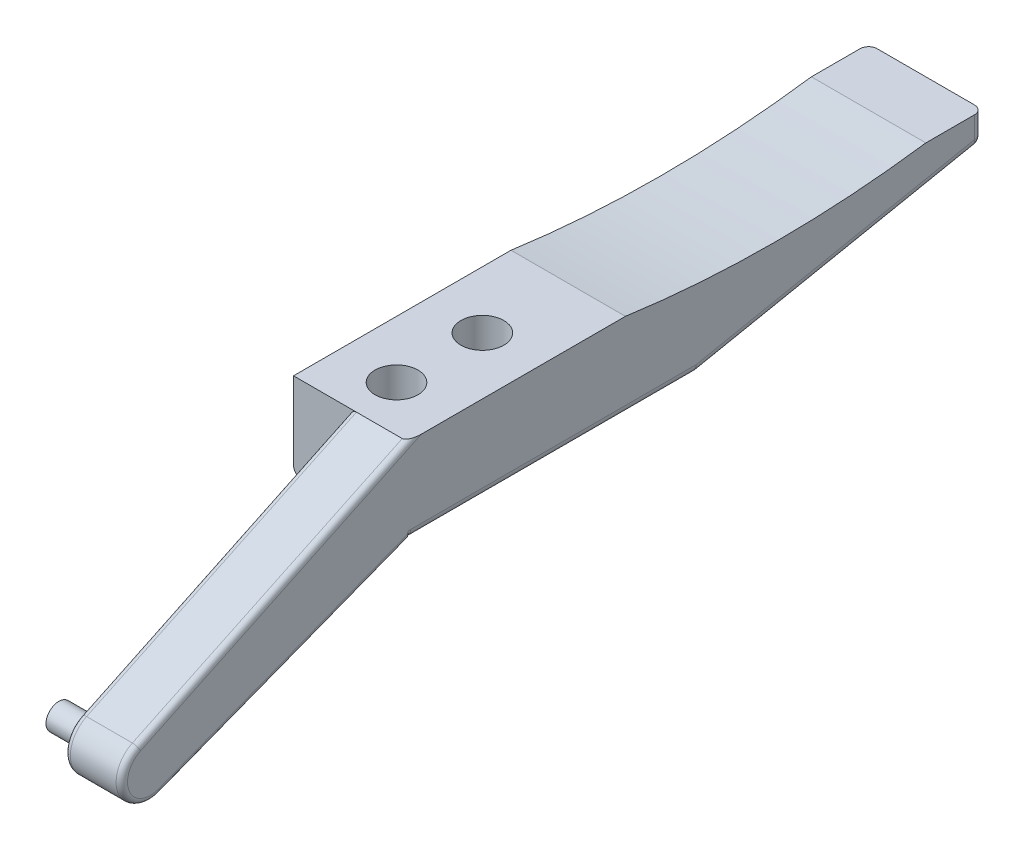
ISO-10303-21;
HEADER;
FILE_DESCRIPTION(('STEP AP214'),'2;1');
FILE_NAME('part.step','',(''),(''),'','','');
FILE_SCHEMA(('AUTOMOTIVE_DESIGN { 1 0 10303 214 1 1 1 1 }'));
ENDSEC;
DATA;
#1=APPLICATION_CONTEXT('core data for automotive mechanical design processes');
#2=APPLICATION_PROTOCOL_DEFINITION('international standard','automotive_design',2000,#1);
#3=PRODUCT_CONTEXT('',#1,'mechanical');
#4=PRODUCT('Part','Part','',(#3));
#5=PRODUCT_RELATED_PRODUCT_CATEGORY('part','',(#4));
#6=PRODUCT_DEFINITION_FORMATION('','',#4);
#7=PRODUCT_DEFINITION_CONTEXT('part definition',#1,'design');
#8=PRODUCT_DEFINITION('design','',#6,#7);
#9=PRODUCT_DEFINITION_SHAPE('','',#8);
#10=(LENGTH_UNIT() NAMED_UNIT(*) SI_UNIT(.MILLI.,.METRE.));
#11=(NAMED_UNIT(*) PLANE_ANGLE_UNIT() SI_UNIT($,.RADIAN.));
#12=(NAMED_UNIT(*) SI_UNIT($,.STERADIAN.) SOLID_ANGLE_UNIT());
#13=UNCERTAINTY_MEASURE_WITH_UNIT(LENGTH_MEASURE(1.E-05),#10,'distance_accuracy_value','');
#14=(GEOMETRIC_REPRESENTATION_CONTEXT(3) GLOBAL_UNCERTAINTY_ASSIGNED_CONTEXT((#13)) GLOBAL_UNIT_ASSIGNED_CONTEXT((#10,
#11,#12)) REPRESENTATION_CONTEXT('',''));
#15=CARTESIAN_POINT('',(0.,0.,0.));
#16=DIRECTION('',(0.,0.,1.));
#17=DIRECTION('',(1.,0.,0.));
#18=AXIS2_PLACEMENT_3D('',#15,#16,#17);
#19=CARTESIAN_POINT('',(20.,-30.,75.));
#20=DIRECTION('',(1.,0.,0.));
#21=DIRECTION('',(0.,0.,-1.));
#22=AXIS2_PLACEMENT_3D('',#19,#20,#21);
#23=PLANE('',#22);
#24=CARTESIAN_POINT('',(20.,-54.0121821289708,166.012182128971));
#25=DIRECTION('',(1.,0.,0.));
#26=DIRECTION('',(0.,0.,-1.));
#27=AXIS2_PLACEMENT_3D('',#24,#25,#26);
#28=CIRCLE('',#27,8.00000000000001);
#29=CARTESIAN_POINT('',(20.,-46.7914786785729,169.456226507519));
#30=VERTEX_POINT('',#29);
#31=CARTESIAN_POINT('',(20.,-61.4758678697103,163.132356585039));
#32=VERTEX_POINT('',#31);
#33=EDGE_CURVE('E188',#30,#32,#28,.T.);
#34=ORIENTED_EDGE('',*,*,#33,.T.);
#35=DIRECTION('',(0.,0.359978192991459,-0.932960717592442));
#36=VECTOR('',#35,1.);
#37=CARTESIAN_POINT('',(20.,-28.1340785648151,76.7199563859829));
#38=LINE('',#37,#36);
#39=CARTESIAN_POINT('',(20.,-27.8562870201426,76.));
#40=VERTEX_POINT('',#39);
#41=EDGE_CURVE('E185',#32,#40,#38,.T.);
#42=ORIENTED_EDGE('',*,*,#41,.T.);
#43=DIRECTION('',(0.,1.,0.));
#44=VECTOR('',#43,1.);
#45=CARTESIAN_POINT('',(20.,0.,76.));
#46=LINE('',#45,#44);
#47=CARTESIAN_POINT('',(20.,-27.,76.));
#48=VERTEX_POINT('',#47);
#49=EDGE_CURVE('E359',#40,#48,#46,.T.);
#50=ORIENTED_EDGE('',*,*,#49,.T.);
#51=DIRECTION('',(0.,0.,-1.));
#52=VECTOR('',#51,1.);
#53=CARTESIAN_POINT('',(20.,-27.,75.));
#54=LINE('',#53,#52);
#55=CARTESIAN_POINT('',(20.,-27.,75.));
#56=VERTEX_POINT('',#55);
#57=EDGE_CURVE('E255',#48,#56,#54,.T.);
#58=ORIENTED_EDGE('',*,*,#57,.T.);
#59=DIRECTION('',(0.,0.,-1.));
#60=VECTOR('',#59,1.);
#61=CARTESIAN_POINT('',(20.,-27.,-25.));
#62=LINE('',#61,#60);
#63=CARTESIAN_POINT('',(20.,-27.,-24.7029414592217));
#64=VERTEX_POINT('',#63);
#65=EDGE_CURVE('E269',#56,#64,#62,.T.);
#66=ORIENTED_EDGE('',*,*,#65,.T.);
#67=DIRECTION('',(0.,-0.196116135138184,0.98058067569092));
#68=VECTOR('',#67,1.);
#69=CARTESIAN_POINT('',(20.,-7.05825797292724,-124.411651594585));
#70=LINE('',#69,#68);
#71=CARTESIAN_POINT('',(20.,-7.54058829184433,-122.));
#72=VERTEX_POINT('',#71);
#73=EDGE_CURVE('E272',#64,#72,#70,.F.);
#74=ORIENTED_EDGE('',*,*,#73,.T.);
#75=DIRECTION('',(0.,-1.,0.));
#76=VECTOR('',#75,1.);
#77=CARTESIAN_POINT('',(20.,-30.,-122.));
#78=LINE('',#77,#76);
#79=CARTESIAN_POINT('',(20.,0.,-122.));
#80=VERTEX_POINT('',#79);
#81=EDGE_CURVE('E281',#72,#80,#78,.F.);
#82=ORIENTED_EDGE('',*,*,#81,.T.);
#83=DIRECTION('',(0.,0.,-1.));
#84=VECTOR('',#83,1.);
#85=CARTESIAN_POINT('',(20.,0.,75.));
#86=LINE('',#85,#84);
#87=CARTESIAN_POINT('',(20.,0.,-105.));
#88=VERTEX_POINT('',#87);
#89=EDGE_CURVE('E256',#88,#80,#86,.T.);
#90=ORIENTED_EDGE('',*,*,#89,.F.);
#91=CARTESIAN_POINT('',(20.,373.93155891124,-52.4999999999999));
#92=DIRECTION('',(1.,0.,0.));
#93=DIRECTION('',(0.,0.,-1.));
#94=AXIS2_PLACEMENT_3D('',#91,#92,#93);
#95=CIRCLE('',#94,377.599074084922);
#96=CARTESIAN_POINT('',(20.,0.,2.08166817117217E-13));
#97=VERTEX_POINT('',#96);
#98=EDGE_CURVE('E215',#97,#88,#95,.T.);
#99=ORIENTED_EDGE('',*,*,#98,.F.);
#100=CARTESIAN_POINT('',(20.,0.,71.3542991200529));
#101=VERTEX_POINT('',#100);
#102=EDGE_CURVE('E205',#101,#97,#86,.T.);
#103=ORIENTED_EDGE('',*,*,#102,.F.);
#104=DIRECTION('',(0.,0.430505547318578,-0.902587931299733));
#105=VECTOR('',#104,1.);
#106=CARTESIAN_POINT('',(20.,-6.9766575393942,85.9813972726549));
#107=LINE('',#106,#105);
#108=EDGE_CURVE('E190',#101,#30,#107,.F.);
#109=ORIENTED_EDGE('',*,*,#108,.T.);
#110=EDGE_LOOP('',(#34,#42,#50,#58,#66,#74,#82,#90,#99,#103,#109));
#111=FACE_BOUND('',#110,.T.);
#112=ADVANCED_FACE('F64',(#111),#23,.T.);
#113=CARTESIAN_POINT('',(0.,-50.0121821289708,125.012182128971));
#114=DIRECTION('',(1.,0.,0.));
#115=DIRECTION('',(0.,0.,-1.));
#116=AXIS2_PLACEMENT_3D('',#113,#114,#115);
#117=PLANE('',#116);
#118=CARTESIAN_POINT('',(0.,-54.0195863765142,166.012182128971));
#119=DIRECTION('',(1.,0.,0.));
#120=DIRECTION('',(0.,0.,-1.));
#121=AXIS2_PLACEMENT_3D('',#118,#119,#120);
#122=CIRCLE('',#121,5.50000000000002);
#123=CARTESIAN_POINT('',(0.,-54.0195863765142,160.512182128971));
#124=VERTEX_POINT('',#123);
#125=EDGE_CURVE('E193',#124,#124,#122,.F.);
#126=ORIENTED_EDGE('',*,*,#125,.F.);
#127=EDGE_LOOP('',(#126));
#128=FACE_BOUND('',#127,.T.);
#129=DIRECTION('',(0.,1.,0.));
#130=VECTOR('',#129,1.);
#131=CARTESIAN_POINT('',(0.,0.,76.));
#132=LINE('',#131,#130);
#133=CARTESIAN_POINT('',(0.,-27.8562870201426,76.));
#134=VERTEX_POINT('',#133);
#135=CARTESIAN_POINT('',(0.,-2.21585058989212,76.));
#136=VERTEX_POINT('',#135);
#137=EDGE_CURVE('E372',#134,#136,#132,.T.);
#138=ORIENTED_EDGE('',*,*,#137,.F.);
#139=DIRECTION('',(0.,0.359978192991459,-0.932960717592442));
#140=VECTOR('',#139,1.);
#141=CARTESIAN_POINT('',(0.,-47.1878646287041,126.101930808641));
#142=LINE('',#141,#140);
#143=CARTESIAN_POINT('',(0.,-61.4758678697103,163.132356585039));
#144=VERTEX_POINT('',#143);
#145=EDGE_CURVE('E143',#134,#144,#142,.F.);
#146=ORIENTED_EDGE('',*,*,#145,.T.);
#147=CARTESIAN_POINT('',(0.,-54.0121821289708,166.012182128971));
#148=DIRECTION('',(1.,0.,0.));
#149=DIRECTION('',(0.,0.,-1.));
#150=AXIS2_PLACEMENT_3D('',#147,#148,#149);
#151=CIRCLE('',#150,8.00000000000001);
#152=CARTESIAN_POINT('',(0.,-46.7914786785729,169.456226507519));
#153=VERTEX_POINT('',#152);
#154=EDGE_CURVE('E136',#144,#153,#151,.F.);
#155=ORIENTED_EDGE('',*,*,#154,.T.);
#156=DIRECTION('',(0.,0.430505547318578,-0.902587931299733));
#157=VECTOR('',#156,1.);
#158=CARTESIAN_POINT('',(0.,-1.80517586259947,75.1389889053628));
#159=LINE('',#158,#157);
#160=EDGE_CURVE('E140',#153,#136,#159,.T.);
#161=ORIENTED_EDGE('',*,*,#160,.T.);
#162=EDGE_LOOP('',(#138,#146,#155,#161));
#163=FACE_BOUND('',#162,.T.);
#164=ADVANCED_FACE('F139',(#128,#163),#117,.F.);
#165=CARTESIAN_POINT('',(0.,0.,76.));
#166=DIRECTION('',(0.,0.,1.));
#167=DIRECTION('',(1.,0.,0.));
#168=AXIS2_PLACEMENT_3D('',#165,#166,#167);
#169=PLANE('',#168);
#170=DIRECTION('',(1.,0.,0.));
#171=VECTOR('',#170,1.);
#172=CARTESIAN_POINT('',(20.,-30.,76.));
#173=LINE('',#172,#171);
#174=CARTESIAN_POINT('',(-17.,-30.,76.));
#175=VERTEX_POINT('',#174);
#176=CARTESIAN_POINT('',(2.,-30.,76.));
#177=VERTEX_POINT('',#176);
#178=EDGE_CURVE('E102',#175,#177,#173,.T.);
#179=ORIENTED_EDGE('',*,*,#178,.T.);
#180=CARTESIAN_POINT('',(2.,-27.8562870201426,76.));
#181=DIRECTION('',(0.,0.,1.));
#182=DIRECTION('',(0.,1.,0.));
#183=AXIS2_PLACEMENT_3D('',#180,#181,#182);
#184=ELLIPSE('',#183,2.14371297985741,2.);
#185=EDGE_CURVE('E73',#177,#134,#184,.F.);
#186=ORIENTED_EDGE('',*,*,#185,.T.);
#187=ORIENTED_EDGE('',*,*,#137,.T.);
#188=CARTESIAN_POINT('',(2.,-2.21585058989211,76.));
#189=DIRECTION('',(0.,0.,1.));
#190=DIRECTION('',(0.,-1.,0.));
#191=AXIS2_PLACEMENT_3D('',#188,#189,#190);
#192=ELLIPSE('',#191,2.2158505898921,2.);
#193=CARTESIAN_POINT('',(2.00000000000003,0.,76.));
#194=VERTEX_POINT('',#193);
#195=EDGE_CURVE('E12',#136,#194,#192,.F.);
#196=ORIENTED_EDGE('',*,*,#195,.T.);
#197=DIRECTION('',(1.,0.,0.));
#198=VECTOR('',#197,1.);
#199=CARTESIAN_POINT('',(20.,0.,76.));
#200=LINE('',#199,#198);
#201=CARTESIAN_POINT('',(-20.,0.,76.));
#202=VERTEX_POINT('',#201);
#203=EDGE_CURVE('E81',#202,#194,#200,.T.);
#204=ORIENTED_EDGE('',*,*,#203,.F.);
#205=DIRECTION('',(0.,-1.,0.));
#206=VECTOR('',#205,1.);
#207=CARTESIAN_POINT('',(-20.,0.,76.));
#208=LINE('',#207,#206);
#209=CARTESIAN_POINT('',(-20.,-27.,76.));
#210=VERTEX_POINT('',#209);
#211=EDGE_CURVE('E196',#202,#210,#208,.T.);
#212=ORIENTED_EDGE('',*,*,#211,.T.);
#213=CARTESIAN_POINT('',(-17.,-27.,76.));
#214=DIRECTION('',(0.,0.,1.));
#215=DIRECTION('',(1.,0.,0.));
#216=AXIS2_PLACEMENT_3D('',#213,#214,#215);
#217=CIRCLE('',#216,3.);
#218=EDGE_CURVE('E203',#210,#175,#217,.T.);
#219=ORIENTED_EDGE('',*,*,#218,.T.);
#220=EDGE_LOOP('',(#179,#186,#187,#196,#204,#212,#219));
#221=FACE_BOUND('',#220,.T.);
#222=ADVANCED_FACE('F396',(#221),#169,.T.);
#223=CARTESIAN_POINT('',(-20.,-30.,75.));
#224=DIRECTION('',(1.,0.,0.));
#225=DIRECTION('',(0.,0.,-1.));
#226=AXIS2_PLACEMENT_3D('',#223,#224,#225);
#227=PLANE('',#226);
#228=DIRECTION('',(0.,0.,-1.));
#229=VECTOR('',#228,1.);
#230=CARTESIAN_POINT('',(-20.,-27.,75.));
#231=LINE('',#230,#229);
#232=CARTESIAN_POINT('',(-20.,-27.,75.));
#233=VERTEX_POINT('',#232);
#234=EDGE_CURVE('E259',#233,#210,#231,.F.);
#235=ORIENTED_EDGE('',*,*,#234,.T.);
#236=ORIENTED_EDGE('',*,*,#211,.F.);
#237=DIRECTION('',(0.,0.,-1.));
#238=VECTOR('',#237,1.);
#239=CARTESIAN_POINT('',(-20.,0.,75.));
#240=LINE('',#239,#238);
#241=CARTESIAN_POINT('',(-20.,0.,2.08166817117217E-13));
#242=VERTEX_POINT('',#241);
#243=EDGE_CURVE('E224',#202,#242,#240,.T.);
#244=ORIENTED_EDGE('',*,*,#243,.T.);
#245=CARTESIAN_POINT('',(-20.,373.93155891124,-52.4999999999999));
#246=DIRECTION('',(1.,0.,0.));
#247=DIRECTION('',(0.,0.,-1.));
#248=AXIS2_PLACEMENT_3D('',#245,#246,#247);
#249=CIRCLE('',#248,377.599074084922);
#250=CARTESIAN_POINT('',(-20.,0.,-105.));
#251=VERTEX_POINT('',#250);
#252=EDGE_CURVE('E220',#242,#251,#249,.T.);
#253=ORIENTED_EDGE('',*,*,#252,.T.);
#254=CARTESIAN_POINT('',(-20.,0.,-122.));
#255=VERTEX_POINT('',#254);
#256=EDGE_CURVE('E223',#251,#255,#240,.T.);
#257=ORIENTED_EDGE('',*,*,#256,.T.);
#258=DIRECTION('',(0.,1.,0.));
#259=VECTOR('',#258,1.);
#260=CARTESIAN_POINT('',(-20.,-10.,-122.));
#261=LINE('',#260,#259);
#262=CARTESIAN_POINT('',(-20.,-7.54058829184433,-122.));
#263=VERTEX_POINT('',#262);
#264=EDGE_CURVE('E296',#255,#263,#261,.F.);
#265=ORIENTED_EDGE('',*,*,#264,.T.);
#266=DIRECTION('',(0.,0.196116135138184,-0.98058067569092));
#267=VECTOR('',#266,1.);
#268=CARTESIAN_POINT('',(-20.,-46.2890272036965,71.7421945592607));
#269=LINE('',#268,#267);
#270=CARTESIAN_POINT('',(-20.,-27.,-24.7029414592217));
#271=VERTEX_POINT('',#270);
#272=EDGE_CURVE('E284',#263,#271,#269,.F.);
#273=ORIENTED_EDGE('',*,*,#272,.T.);
#274=DIRECTION('',(0.,0.,-1.));
#275=VECTOR('',#274,1.);
#276=CARTESIAN_POINT('',(-20.,-27.,75.));
#277=LINE('',#276,#275);
#278=EDGE_CURVE('E206',#271,#233,#277,.F.);
#279=ORIENTED_EDGE('',*,*,#278,.T.);
#280=EDGE_LOOP('',(#235,#236,#244,#253,#257,#265,#273,#279));
#281=FACE_BOUND('',#280,.T.);
#282=ADVANCED_FACE('F402',(#281),#227,.F.);
#283=CARTESIAN_POINT('',(0.,0.,0.));
#284=DIRECTION('',(0.,1.,0.));
#285=DIRECTION('',(0.,0.,1.));
#286=AXIS2_PLACEMENT_3D('',#283,#284,#285);
#287=PLANE('',#286);
#288=CARTESIAN_POINT('',(0.,0.,60.));
#289=DIRECTION('',(0.,1.,0.));
#290=DIRECTION('',(0.,0.,1.));
#291=AXIS2_PLACEMENT_3D('',#288,#289,#290);
#292=CIRCLE('',#291,7.5);
#293=CARTESIAN_POINT('',(0.,0.,67.5));
#294=VERTEX_POINT('',#293);
#295=EDGE_CURVE('E245',#294,#294,#292,.T.);
#296=ORIENTED_EDGE('',*,*,#295,.F.);
#297=EDGE_LOOP('',(#296));
#298=FACE_BOUND('',#297,.T.);
#299=CARTESIAN_POINT('',(0.,0.,30.));
#300=DIRECTION('',(0.,1.,0.));
#301=DIRECTION('',(0.,0.,1.));
#302=AXIS2_PLACEMENT_3D('',#299,#300,#301);
#303=CIRCLE('',#302,7.5);
#304=CARTESIAN_POINT('',(0.,0.,37.5));
#305=VERTEX_POINT('',#304);
#306=EDGE_CURVE('E249',#305,#305,#303,.T.);
#307=ORIENTED_EDGE('',*,*,#306,.F.);
#308=EDGE_LOOP('',(#307));
#309=FACE_BOUND('',#308,.T.);
#310=DIRECTION('',(-1.,0.,0.));
#311=VECTOR('',#310,1.);
#312=CARTESIAN_POINT('',(104.165905469516,0.,76.));
#313=LINE('',#312,#311);
#314=CARTESIAN_POINT('',(18.,0.,76.));
#315=VERTEX_POINT('',#314);
#316=EDGE_CURVE('E367',#315,#194,#313,.T.);
#317=ORIENTED_EDGE('',*,*,#316,.F.);
#318=CARTESIAN_POINT('',(18.,0.,71.3542991200529));
#319=DIRECTION('',(0.,1.,0.));
#320=DIRECTION('',(0.,0.,-1.));
#321=AXIS2_PLACEMENT_3D('',#318,#319,#320);
#322=ELLIPSE('',#321,4.64570087994704,2.);
#323=EDGE_CURVE('E170',#315,#101,#322,.T.);
#324=ORIENTED_EDGE('',*,*,#323,.T.);
#325=ORIENTED_EDGE('',*,*,#102,.T.);
#326=DIRECTION('',(1.,0.,0.));
#327=VECTOR('',#326,1.);
#328=CARTESIAN_POINT('',(-30.,0.,2.08166817117217E-13));
#329=LINE('',#328,#327);
#330=EDGE_CURVE('E219',#242,#97,#329,.T.);
#331=ORIENTED_EDGE('',*,*,#330,.F.);
#332=ORIENTED_EDGE('',*,*,#243,.F.);
#333=ORIENTED_EDGE('',*,*,#203,.T.);
#334=EDGE_LOOP('',(#317,#324,#325,#331,#332,#333));
#335=FACE_BOUND('',#334,.T.);
#336=ADVANCED_FACE('F475',(#298,#309,#335),#287,.T.);
#337=CARTESIAN_POINT('',(0.,-30.,0.));
#338=DIRECTION('',(0.,1.,0.));
#339=DIRECTION('',(0.,0.,1.));
#340=AXIS2_PLACEMENT_3D('',#337,#338,#339);
#341=PLANE('',#340);
#342=CARTESIAN_POINT('',(0.,-30.,30.));
#343=DIRECTION('',(0.,-1.,0.));
#344=DIRECTION('',(0.,0.,-1.));
#345=AXIS2_PLACEMENT_3D('',#342,#343,#344);
#346=CIRCLE('',#345,6.);
#347=CARTESIAN_POINT('',(0.,-30.,24.));
#348=VERTEX_POINT('',#347);
#349=EDGE_CURVE('E230',#348,#348,#346,.T.);
#350=ORIENTED_EDGE('',*,*,#349,.F.);
#351=EDGE_LOOP('',(#350));
#352=FACE_BOUND('',#351,.T.);
#353=CARTESIAN_POINT('',(0.,-30.,60.));
#354=DIRECTION('',(0.,-1.,0.));
#355=DIRECTION('',(0.,0.,-1.));
#356=AXIS2_PLACEMENT_3D('',#353,#354,#355);
#357=CIRCLE('',#356,6.);
#358=CARTESIAN_POINT('',(0.,-30.,54.));
#359=VERTEX_POINT('',#358);
#360=EDGE_CURVE('E229',#359,#359,#357,.T.);
#361=ORIENTED_EDGE('',*,*,#360,.F.);
#362=EDGE_LOOP('',(#361));
#363=FACE_BOUND('',#362,.T.);
#364=DIRECTION('',(0.,0.,-1.));
#365=VECTOR('',#364,1.);
#366=CARTESIAN_POINT('',(17.,-30.,135.));
#367=LINE('',#366,#365);
#368=CARTESIAN_POINT('',(17.,-30.,-24.7029414592216));
#369=VERTEX_POINT('',#368);
#370=CARTESIAN_POINT('',(17.,-30.,75.));
#371=VERTEX_POINT('',#370);
#372=EDGE_CURVE('E277',#369,#371,#367,.F.);
#373=ORIENTED_EDGE('',*,*,#372,.T.);
#374=DIRECTION('',(0.,0.,-1.));
#375=VECTOR('',#374,1.);
#376=CARTESIAN_POINT('',(17.,-30.,76.));
#377=LINE('',#376,#375);
#378=CARTESIAN_POINT('',(17.,-30.,76.));
#379=VERTEX_POINT('',#378);
#380=EDGE_CURVE('E280',#371,#379,#377,.F.);
#381=ORIENTED_EDGE('',*,*,#380,.T.);
#382=EDGE_CURVE('E209',#177,#379,#173,.T.);
#383=ORIENTED_EDGE('',*,*,#382,.F.);
#384=ORIENTED_EDGE('',*,*,#178,.F.);
#385=DIRECTION('',(0.,0.,-1.));
#386=VECTOR('',#385,1.);
#387=CARTESIAN_POINT('',(-17.,-30.,0.));
#388=LINE('',#387,#386);
#389=CARTESIAN_POINT('',(-17.,-30.,75.));
#390=VERTEX_POINT('',#389);
#391=EDGE_CURVE('E276',#175,#390,#388,.T.);
#392=ORIENTED_EDGE('',*,*,#391,.T.);
#393=DIRECTION('',(0.,0.,-1.));
#394=VECTOR('',#393,1.);
#395=CARTESIAN_POINT('',(-17.,-30.,0.));
#396=LINE('',#395,#394);
#397=CARTESIAN_POINT('',(-17.,-30.,-24.7029414592217));
#398=VERTEX_POINT('',#397);
#399=EDGE_CURVE('E273',#390,#398,#396,.T.);
#400=ORIENTED_EDGE('',*,*,#399,.T.);
#401=DIRECTION('',(-1.,0.,0.));
#402=VECTOR('',#401,1.);
#403=CARTESIAN_POINT('',(0.,-30.,-24.7029414592217));
#404=LINE('',#403,#402);
#405=EDGE_CURVE('E214',#398,#369,#404,.F.);
#406=ORIENTED_EDGE('',*,*,#405,.T.);
#407=EDGE_LOOP('',(#373,#381,#383,#384,#392,#400,#406));
#408=FACE_BOUND('',#407,.T.);
#409=ADVANCED_FACE('F470',(#352,#363,#408),#341,.F.);
#410=CARTESIAN_POINT('',(17.,-27.,75.));
#411=DIRECTION('',(0.,0.,1.));
#412=DIRECTION('',(1.,0.,0.));
#413=AXIS2_PLACEMENT_3D('',#410,#411,#412);
#414=CYLINDRICAL_SURFACE('',#413,3.);
#415=ORIENTED_EDGE('',*,*,#65,.F.);
#416=CARTESIAN_POINT('',(17.,-27.,75.));
#417=DIRECTION('',(0.,0.,1.));
#418=DIRECTION('',(1.,0.,0.));
#419=AXIS2_PLACEMENT_3D('',#416,#417,#418);
#420=CIRCLE('',#419,3.);
#421=EDGE_CURVE('E210',#56,#371,#420,.F.);
#422=ORIENTED_EDGE('',*,*,#421,.T.);
#423=ORIENTED_EDGE('',*,*,#372,.F.);
#424=CARTESIAN_POINT('',(17.,-27.,-24.7029414592217));
#425=DIRECTION('',(0.,0.,1.));
#426=DIRECTION('',(1.,0.,0.));
#427=AXIS2_PLACEMENT_3D('',#424,#425,#426);
#428=CIRCLE('',#427,3.);
#429=EDGE_CURVE('E213',#369,#64,#428,.T.);
#430=ORIENTED_EDGE('',*,*,#429,.T.);
#431=EDGE_LOOP('',(#415,#422,#423,#430));
#432=FACE_BOUND('',#431,.T.);
#433=ADVANCED_FACE('F467',(#432),#414,.T.);
#434=CARTESIAN_POINT('',(-17.,-27.,0.));
#435=DIRECTION('',(0.,0.,-1.));
#436=DIRECTION('',(-1.,0.,0.));
#437=AXIS2_PLACEMENT_3D('',#434,#435,#436);
#438=CYLINDRICAL_SURFACE('',#437,3.);
#439=ORIENTED_EDGE('',*,*,#399,.F.);
#440=CARTESIAN_POINT('',(-17.,-27.,75.));
#441=DIRECTION('',(0.,0.,1.));
#442=DIRECTION('',(1.,0.,0.));
#443=AXIS2_PLACEMENT_3D('',#440,#441,#442);
#444=CIRCLE('',#443,3.);
#445=EDGE_CURVE('E303',#390,#233,#444,.F.);
#446=ORIENTED_EDGE('',*,*,#445,.T.);
#447=ORIENTED_EDGE('',*,*,#278,.F.);
#448=CARTESIAN_POINT('',(-17.,-27.,-24.7029414592217));
#449=DIRECTION('',(0.,0.,-1.));
#450=DIRECTION('',(-1.,0.,0.));
#451=AXIS2_PLACEMENT_3D('',#448,#449,#450);
#452=CIRCLE('',#451,3.);
#453=EDGE_CURVE('E252',#271,#398,#452,.F.);
#454=ORIENTED_EDGE('',*,*,#453,.T.);
#455=EDGE_LOOP('',(#439,#446,#447,#454));
#456=FACE_BOUND('',#455,.T.);
#457=ADVANCED_FACE('F463',(#456),#438,.T.);
#458=CARTESIAN_POINT('',(0.,-30.,30.));
#459=DIRECTION('',(0.,1.,0.));
#460=DIRECTION('',(0.,0.,1.));
#461=AXIS2_PLACEMENT_3D('',#458,#459,#460);
#462=CYLINDRICAL_SURFACE('',#461,7.5);
#463=ORIENTED_EDGE('',*,*,#306,.T.);
#464=EDGE_LOOP('',(#463));
#465=FACE_BOUND('',#464,.T.);
#466=CARTESIAN_POINT('',(0.,-25.,30.));
#467=DIRECTION('',(0.,-1.,0.));
#468=DIRECTION('',(0.,0.,-1.));
#469=AXIS2_PLACEMENT_3D('',#466,#467,#468);
#470=CIRCLE('',#469,7.5);
#471=CARTESIAN_POINT('',(0.,-25.,22.5));
#472=VERTEX_POINT('',#471);
#473=EDGE_CURVE('E228',#472,#472,#470,.F.);
#474=ORIENTED_EDGE('',*,*,#473,.F.);
#475=EDGE_LOOP('',(#474));
#476=FACE_BOUND('',#475,.T.);
#477=ADVANCED_FACE('F466',(#465,#476),#462,.F.);
#478=CARTESIAN_POINT('',(0.,-30.,60.));
#479=DIRECTION('',(0.,1.,0.));
#480=DIRECTION('',(0.,0.,1.));
#481=AXIS2_PLACEMENT_3D('',#478,#479,#480);
#482=CYLINDRICAL_SURFACE('',#481,7.5);
#483=ORIENTED_EDGE('',*,*,#295,.T.);
#484=EDGE_LOOP('',(#483));
#485=FACE_BOUND('',#484,.T.);
#486=CARTESIAN_POINT('',(0.,-25.,60.));
#487=DIRECTION('',(0.,-1.,0.));
#488=DIRECTION('',(0.,0.,-1.));
#489=AXIS2_PLACEMENT_3D('',#486,#487,#488);
#490=CIRCLE('',#489,7.5);
#491=CARTESIAN_POINT('',(0.,-25.,52.5));
#492=VERTEX_POINT('',#491);
#493=EDGE_CURVE('E236',#492,#492,#490,.F.);
#494=ORIENTED_EDGE('',*,*,#493,.F.);
#495=EDGE_LOOP('',(#494));
#496=FACE_BOUND('',#495,.T.);
#497=ADVANCED_FACE('F481',(#485,#496),#482,.F.);
#498=DIRECTION('',(1.,0.,0.));
#499=VECTOR('',#498,1.);
#500=CARTESIAN_POINT('',(20.,0.,-125.));
#501=LINE('',#500,#499);
#502=CARTESIAN_POINT('',(-17.,0.,-125.));
#503=VERTEX_POINT('',#502);
#504=CARTESIAN_POINT('',(17.,0.,-125.));
#505=VERTEX_POINT('',#504);
#506=EDGE_CURVE('E240',#503,#505,#501,.T.);
#507=ORIENTED_EDGE('',*,*,#506,.F.);
#508=CARTESIAN_POINT('',(-17.,0.,-122.));
#509=DIRECTION('',(0.,1.,0.));
#510=DIRECTION('',(0.,0.,1.));
#511=AXIS2_PLACEMENT_3D('',#508,#509,#510);
#512=CIRCLE('',#511,3.);
#513=EDGE_CURVE('E248',#503,#255,#512,.T.);
#514=ORIENTED_EDGE('',*,*,#513,.T.);
#515=ORIENTED_EDGE('',*,*,#256,.F.);
#516=DIRECTION('',(1.,0.,0.));
#517=VECTOR('',#516,1.);
#518=CARTESIAN_POINT('',(-30.,0.,-105.));
#519=LINE('',#518,#517);
#520=EDGE_CURVE('E218',#88,#251,#519,.F.);
#521=ORIENTED_EDGE('',*,*,#520,.F.);
#522=ORIENTED_EDGE('',*,*,#89,.T.);
#523=CARTESIAN_POINT('',(17.,0.,-122.));
#524=DIRECTION('',(0.,1.,0.));
#525=DIRECTION('',(0.,0.,1.));
#526=AXIS2_PLACEMENT_3D('',#523,#524,#525);
#527=CIRCLE('',#526,3.);
#528=EDGE_CURVE('E311',#80,#505,#527,.T.);
#529=ORIENTED_EDGE('',*,*,#528,.T.);
#530=EDGE_LOOP('',(#507,#514,#515,#521,#522,#529));
#531=FACE_BOUND('',#530,.T.);
#532=ADVANCED_FACE('F477',(#531),#287,.T.);
#533=CARTESIAN_POINT('',(0.,0.,-125.));
#534=DIRECTION('',(0.,0.,-1.));
#535=DIRECTION('',(-1.,0.,0.));
#536=AXIS2_PLACEMENT_3D('',#533,#534,#535);
#537=PLANE('',#536);
#538=DIRECTION('',(1.,0.,0.));
#539=VECTOR('',#538,1.);
#540=CARTESIAN_POINT('',(-20.,-7.54058829184433,-125.));
#541=LINE('',#540,#539);
#542=CARTESIAN_POINT('',(17.,-7.54058829184433,-125.));
#543=VERTEX_POINT('',#542);
#544=CARTESIAN_POINT('',(-17.,-7.54058829184433,-125.));
#545=VERTEX_POINT('',#544);
#546=EDGE_CURVE('E308',#543,#545,#541,.F.);
#547=ORIENTED_EDGE('',*,*,#546,.T.);
#548=DIRECTION('',(0.,1.,0.));
#549=VECTOR('',#548,1.);
#550=CARTESIAN_POINT('',(-17.,0.,-125.));
#551=LINE('',#550,#549);
#552=EDGE_CURVE('E244',#545,#503,#551,.T.);
#553=ORIENTED_EDGE('',*,*,#552,.T.);
#554=ORIENTED_EDGE('',*,*,#506,.T.);
#555=DIRECTION('',(0.,-1.,0.));
#556=VECTOR('',#555,1.);
#557=CARTESIAN_POINT('',(17.,0.,-125.));
#558=LINE('',#557,#556);
#559=EDGE_CURVE('E243',#505,#543,#558,.T.);
#560=ORIENTED_EDGE('',*,*,#559,.T.);
#561=EDGE_LOOP('',(#547,#553,#554,#560));
#562=FACE_BOUND('',#561,.T.);
#563=ADVANCED_FACE('F480',(#562),#537,.T.);
#564=CARTESIAN_POINT('',(30.,-10.,-125.));
#565=DIRECTION('',(0.,0.98058067569092,0.196116135138184));
#566=DIRECTION('',(0.,-0.196116135138184,0.98058067569092));
#567=AXIS2_PLACEMENT_3D('',#564,#565,#566);
#568=PLANE('',#567);
#569=DIRECTION('',(-1.,0.,0.));
#570=VECTOR('',#569,1.);
#571=CARTESIAN_POINT('',(30.,-29.9417420270728,-25.2912898646362));
#572=LINE('',#571,#570);
#573=CARTESIAN_POINT('',(17.,-29.9417420270728,-25.2912898646362));
#574=VERTEX_POINT('',#573);
#575=CARTESIAN_POINT('',(-17.,-29.9417420270728,-25.2912898646362));
#576=VERTEX_POINT('',#575);
#577=EDGE_CURVE('E291',#574,#576,#572,.T.);
#578=ORIENTED_EDGE('',*,*,#577,.T.);
#579=DIRECTION('',(0.,0.196116135138184,-0.98058067569092));
#580=VECTOR('',#579,1.);
#581=CARTESIAN_POINT('',(-17.,-10.,-125.));
#582=LINE('',#581,#580);
#583=CARTESIAN_POINT('',(-17.,-10.4823303189171,-122.588348405415));
#584=VERTEX_POINT('',#583);
#585=EDGE_CURVE('E290',#576,#584,#582,.T.);
#586=ORIENTED_EDGE('',*,*,#585,.T.);
#587=DIRECTION('',(1.,0.,0.));
#588=VECTOR('',#587,1.);
#589=CARTESIAN_POINT('',(20.,-10.4823303189171,-122.588348405415));
#590=LINE('',#589,#588);
#591=CARTESIAN_POINT('',(17.,-10.4823303189171,-122.588348405415));
#592=VERTEX_POINT('',#591);
#593=EDGE_CURVE('E287',#584,#592,#590,.T.);
#594=ORIENTED_EDGE('',*,*,#593,.T.);
#595=DIRECTION('',(0.,-0.196116135138184,0.98058067569092));
#596=VECTOR('',#595,1.);
#597=CARTESIAN_POINT('',(17.,-27.,-40.));
#598=LINE('',#597,#596);
#599=EDGE_CURVE('E237',#592,#574,#598,.T.);
#600=ORIENTED_EDGE('',*,*,#599,.T.);
#601=EDGE_LOOP('',(#578,#586,#594,#600));
#602=FACE_BOUND('',#601,.T.);
#603=ADVANCED_FACE('F494',(#602),#568,.F.);
#604=CARTESIAN_POINT('',(0.,-25.,60.));
#605=DIRECTION('',(0.,-1.,0.));
#606=DIRECTION('',(0.,0.,-1.));
#607=AXIS2_PLACEMENT_3D('',#604,#605,#606);
#608=PLANE('',#607);
#609=CARTESIAN_POINT('',(0.,-25.,60.));
#610=DIRECTION('',(0.,-1.,0.));
#611=DIRECTION('',(0.,0.,-1.));
#612=AXIS2_PLACEMENT_3D('',#609,#610,#611);
#613=CIRCLE('',#612,6.);
#614=CARTESIAN_POINT('',(0.,-25.,54.));
#615=VERTEX_POINT('',#614);
#616=EDGE_CURVE('E233',#615,#615,#613,.T.);
#617=ORIENTED_EDGE('',*,*,#616,.T.);
#618=EDGE_LOOP('',(#617));
#619=FACE_BOUND('',#618,.T.);
#620=ORIENTED_EDGE('',*,*,#493,.T.);
#621=EDGE_LOOP('',(#620));
#622=FACE_BOUND('',#621,.T.);
#623=ADVANCED_FACE('F498',(#619,#622),#608,.F.);
#624=CARTESIAN_POINT('',(0.,-25.,60.));
#625=DIRECTION('',(0.,-1.,0.));
#626=DIRECTION('',(0.,0.,-1.));
#627=AXIS2_PLACEMENT_3D('',#624,#625,#626);
#628=CYLINDRICAL_SURFACE('',#627,6.);
#629=ORIENTED_EDGE('',*,*,#616,.F.);
#630=EDGE_LOOP('',(#629));
#631=FACE_BOUND('',#630,.T.);
#632=ORIENTED_EDGE('',*,*,#360,.T.);
#633=EDGE_LOOP('',(#632));
#634=FACE_BOUND('',#633,.T.);
#635=ADVANCED_FACE('F502',(#631,#634),#628,.F.);
#636=CARTESIAN_POINT('',(0.,-25.,30.));
#637=DIRECTION('',(0.,-1.,0.));
#638=DIRECTION('',(0.,0.,-1.));
#639=AXIS2_PLACEMENT_3D('',#636,#637,#638);
#640=PLANE('',#639);
#641=CARTESIAN_POINT('',(0.,-25.,30.));
#642=DIRECTION('',(0.,-1.,0.));
#643=DIRECTION('',(0.,0.,-1.));
#644=AXIS2_PLACEMENT_3D('',#641,#642,#643);
#645=CIRCLE('',#644,6.);
#646=CARTESIAN_POINT('',(0.,-25.,24.));
#647=VERTEX_POINT('',#646);
#648=EDGE_CURVE('E225',#647,#647,#645,.T.);
#649=ORIENTED_EDGE('',*,*,#648,.T.);
#650=EDGE_LOOP('',(#649));
#651=FACE_BOUND('',#650,.T.);
#652=ORIENTED_EDGE('',*,*,#473,.T.);
#653=EDGE_LOOP('',(#652));
#654=FACE_BOUND('',#653,.T.);
#655=ADVANCED_FACE('F506',(#651,#654),#640,.F.);
#656=CARTESIAN_POINT('',(0.,-25.,30.));
#657=DIRECTION('',(0.,-1.,0.));
#658=DIRECTION('',(0.,0.,-1.));
#659=AXIS2_PLACEMENT_3D('',#656,#657,#658);
#660=CYLINDRICAL_SURFACE('',#659,6.);
#661=ORIENTED_EDGE('',*,*,#648,.F.);
#662=EDGE_LOOP('',(#661));
#663=FACE_BOUND('',#662,.T.);
#664=ORIENTED_EDGE('',*,*,#349,.T.);
#665=EDGE_LOOP('',(#664));
#666=FACE_BOUND('',#665,.T.);
#667=ADVANCED_FACE('F510',(#663,#666),#660,.F.);
#668=CARTESIAN_POINT('',(-30.,373.93155891124,-52.4999999999999));
#669=DIRECTION('',(1.,0.,0.));
#670=DIRECTION('',(0.,0.,-1.));
#671=AXIS2_PLACEMENT_3D('',#668,#669,#670);
#672=CYLINDRICAL_SURFACE('',#671,377.599074084922);
#673=ORIENTED_EDGE('',*,*,#330,.T.);
#674=ORIENTED_EDGE('',*,*,#98,.T.);
#675=ORIENTED_EDGE('',*,*,#520,.T.);
#676=ORIENTED_EDGE('',*,*,#252,.F.);
#677=EDGE_LOOP('',(#673,#674,#675,#676));
#678=FACE_BOUND('',#677,.T.);
#679=ADVANCED_FACE('F427',(#678),#672,.F.);
#680=CARTESIAN_POINT('',(17.,-7.05825797292724,-124.411651594585));
#681=DIRECTION('',(0.,0.196116135138184,-0.98058067569092));
#682=DIRECTION('',(0.,0.98058067569092,0.196116135138184));
#683=AXIS2_PLACEMENT_3D('',#680,#681,#682);
#684=CYLINDRICAL_SURFACE('',#683,3.);
#685=CARTESIAN_POINT('',(17.,-7.54058829184433,-122.));
#686=DIRECTION('',(0.,0.196116135138184,-0.98058067569092));
#687=DIRECTION('',(0.,0.98058067569092,0.196116135138184));
#688=AXIS2_PLACEMENT_3D('',#685,#686,#687);
#689=CIRCLE('',#688,3.);
#690=EDGE_CURVE('E345',#72,#592,#689,.T.);
#691=ORIENTED_EDGE('',*,*,#690,.F.);
#692=ORIENTED_EDGE('',*,*,#73,.F.);
#693=CARTESIAN_POINT('',(17.,-27.,-24.7029414592217));
#694=DIRECTION('',(0.,-0.196116135138184,0.98058067569092));
#695=DIRECTION('',(0.,-0.98058067569092,-0.196116135138184));
#696=AXIS2_PLACEMENT_3D('',#693,#694,#695);
#697=CIRCLE('',#696,3.);
#698=EDGE_CURVE('E266',#574,#64,#697,.T.);
#699=ORIENTED_EDGE('',*,*,#698,.F.);
#700=ORIENTED_EDGE('',*,*,#599,.F.);
#701=EDGE_LOOP('',(#691,#692,#699,#700));
#702=FACE_BOUND('',#701,.T.);
#703=ADVANCED_FACE('F423',(#702),#684,.T.);
#704=CARTESIAN_POINT('',(17.,0.,-122.));
#705=DIRECTION('',(0.,-1.,0.));
#706=DIRECTION('',(0.,0.,-1.));
#707=AXIS2_PLACEMENT_3D('',#704,#705,#706);
#708=CYLINDRICAL_SURFACE('',#707,3.);
#709=ORIENTED_EDGE('',*,*,#528,.F.);
#710=ORIENTED_EDGE('',*,*,#81,.F.);
#711=CARTESIAN_POINT('',(17.,-7.54058829184433,-122.));
#712=DIRECTION('',(0.,-1.,0.));
#713=DIRECTION('',(0.,0.,-1.));
#714=AXIS2_PLACEMENT_3D('',#711,#712,#713);
#715=CIRCLE('',#714,3.);
#716=EDGE_CURVE('E346',#543,#72,#715,.T.);
#717=ORIENTED_EDGE('',*,*,#716,.F.);
#718=ORIENTED_EDGE('',*,*,#559,.F.);
#719=EDGE_LOOP('',(#709,#710,#717,#718));
#720=FACE_BOUND('',#719,.T.);
#721=ADVANCED_FACE('F426',(#720),#708,.T.);
#722=CARTESIAN_POINT('',(17.,-27.,-24.7029414592217));
#723=DIRECTION('',(0.,0.98058067569092,0.196116135138184));
#724=DIRECTION('',(0.,-0.196116135138184,0.98058067569092));
#725=AXIS2_PLACEMENT_3D('',#722,#723,#724);
#726=SPHERICAL_SURFACE('',#725,3.);
#727=ORIENTED_EDGE('',*,*,#698,.T.);
#728=ORIENTED_EDGE('',*,*,#429,.F.);
#729=CARTESIAN_POINT('',(17.,-27.,-24.7029414592217));
#730=DIRECTION('',(-1.,0.,0.));
#731=DIRECTION('',(0.,0.,1.));
#732=AXIS2_PLACEMENT_3D('',#729,#730,#731);
#733=CIRCLE('',#732,3.);
#734=EDGE_CURVE('E342',#574,#369,#733,.T.);
#735=ORIENTED_EDGE('',*,*,#734,.F.);
#736=EDGE_LOOP('',(#727,#728,#735));
#737=FACE_BOUND('',#736,.T.);
#738=ADVANCED_FACE('F431',(#737),#726,.T.);
#739=CARTESIAN_POINT('',(17.,-7.54058829184433,-122.));
#740=DIRECTION('',(0.,0.,1.));
#741=DIRECTION('',(1.,0.,0.));
#742=AXIS2_PLACEMENT_3D('',#739,#740,#741);
#743=SPHERICAL_SURFACE('',#742,3.);
#744=ORIENTED_EDGE('',*,*,#716,.T.);
#745=ORIENTED_EDGE('',*,*,#690,.T.);
#746=CARTESIAN_POINT('',(17.,-7.54058829184433,-122.));
#747=DIRECTION('',(1.,0.,0.));
#748=DIRECTION('',(0.,0.,-1.));
#749=AXIS2_PLACEMENT_3D('',#746,#747,#748);
#750=CIRCLE('',#749,3.);
#751=EDGE_CURVE('E339',#543,#592,#750,.F.);
#752=ORIENTED_EDGE('',*,*,#751,.F.);
#753=EDGE_LOOP('',(#744,#745,#752));
#754=FACE_BOUND('',#753,.T.);
#755=ADVANCED_FACE('F435',(#754),#743,.T.);
#756=CARTESIAN_POINT('',(30.,-27.,-24.7029414592217));
#757=DIRECTION('',(-1.,0.,0.));
#758=DIRECTION('',(0.,0.,1.));
#759=AXIS2_PLACEMENT_3D('',#756,#757,#758);
#760=CYLINDRICAL_SURFACE('',#759,3.);
#761=ORIENTED_EDGE('',*,*,#734,.T.);
#762=ORIENTED_EDGE('',*,*,#405,.F.);
#763=CARTESIAN_POINT('',(-17.,-27.,-24.7029414592217));
#764=DIRECTION('',(-1.,0.,0.));
#765=DIRECTION('',(0.,0.,1.));
#766=AXIS2_PLACEMENT_3D('',#763,#764,#765);
#767=CIRCLE('',#766,3.);
#768=EDGE_CURVE('E334',#576,#398,#767,.T.);
#769=ORIENTED_EDGE('',*,*,#768,.F.);
#770=ORIENTED_EDGE('',*,*,#577,.F.);
#771=EDGE_LOOP('',(#761,#762,#769,#770));
#772=FACE_BOUND('',#771,.T.);
#773=ADVANCED_FACE('F439',(#772),#760,.T.);
#774=CARTESIAN_POINT('',(30.,-7.54058829184433,-122.));
#775=DIRECTION('',(-1.,0.,0.));
#776=DIRECTION('',(0.,0.,1.));
#777=AXIS2_PLACEMENT_3D('',#774,#775,#776);
#778=CYLINDRICAL_SURFACE('',#777,3.);
#779=ORIENTED_EDGE('',*,*,#751,.T.);
#780=ORIENTED_EDGE('',*,*,#593,.F.);
#781=CARTESIAN_POINT('',(-17.,-7.54058829184433,-122.));
#782=DIRECTION('',(-1.,0.,0.));
#783=DIRECTION('',(0.,-1.,0.));
#784=AXIS2_PLACEMENT_3D('',#781,#782,#783);
#785=CIRCLE('',#784,3.);
#786=EDGE_CURVE('E330',#545,#584,#785,.T.);
#787=ORIENTED_EDGE('',*,*,#786,.F.);
#788=ORIENTED_EDGE('',*,*,#546,.F.);
#789=EDGE_LOOP('',(#779,#780,#787,#788));
#790=FACE_BOUND('',#789,.T.);
#791=ADVANCED_FACE('F443',(#790),#778,.T.);
#792=CARTESIAN_POINT('',(-17.,0.,-122.));
#793=DIRECTION('',(0.,-1.,0.));
#794=DIRECTION('',(0.,0.,-1.));
#795=AXIS2_PLACEMENT_3D('',#792,#793,#794);
#796=CYLINDRICAL_SURFACE('',#795,3.);
#797=ORIENTED_EDGE('',*,*,#513,.F.);
#798=ORIENTED_EDGE('',*,*,#552,.F.);
#799=CARTESIAN_POINT('',(-17.,-7.54058829184433,-122.));
#800=DIRECTION('',(0.,-1.,0.));
#801=DIRECTION('',(0.,0.,-1.));
#802=AXIS2_PLACEMENT_3D('',#799,#800,#801);
#803=CIRCLE('',#802,3.);
#804=EDGE_CURVE('E331',#263,#545,#803,.T.);
#805=ORIENTED_EDGE('',*,*,#804,.F.);
#806=ORIENTED_EDGE('',*,*,#264,.F.);
#807=EDGE_LOOP('',(#797,#798,#805,#806));
#808=FACE_BOUND('',#807,.T.);
#809=ADVANCED_FACE('F447',(#808),#796,.T.);
#810=CARTESIAN_POINT('',(-17.,-27.,-24.7029414592217));
#811=DIRECTION('',(0.,0.98058067569092,0.196116135138184));
#812=DIRECTION('',(0.,-0.196116135138184,0.98058067569092));
#813=AXIS2_PLACEMENT_3D('',#810,#811,#812);
#814=SPHERICAL_SURFACE('',#813,3.);
#815=ORIENTED_EDGE('',*,*,#768,.T.);
#816=ORIENTED_EDGE('',*,*,#453,.F.);
#817=CARTESIAN_POINT('',(-17.,-27.,-24.7029414592217));
#818=DIRECTION('',(0.,0.196116135138184,-0.98058067569092));
#819=DIRECTION('',(0.,0.98058067569092,0.196116135138184));
#820=AXIS2_PLACEMENT_3D('',#817,#818,#819);
#821=CIRCLE('',#820,3.);
#822=EDGE_CURVE('E327',#576,#271,#821,.T.);
#823=ORIENTED_EDGE('',*,*,#822,.F.);
#824=EDGE_LOOP('',(#815,#816,#823));
#825=FACE_BOUND('',#824,.T.);
#826=ADVANCED_FACE('F451',(#825),#814,.T.);
#827=CARTESIAN_POINT('',(-17.,-7.54058829184433,-122.));
#828=DIRECTION('',(0.,0.,1.));
#829=DIRECTION('',(1.,0.,0.));
#830=AXIS2_PLACEMENT_3D('',#827,#828,#829);
#831=SPHERICAL_SURFACE('',#830,3.);
#832=ORIENTED_EDGE('',*,*,#804,.T.);
#833=ORIENTED_EDGE('',*,*,#786,.T.);
#834=CARTESIAN_POINT('',(-17.,-7.54058829184433,-122.));
#835=DIRECTION('',(0.,0.196116135138184,-0.98058067569092));
#836=DIRECTION('',(0.,0.98058067569092,0.196116135138184));
#837=AXIS2_PLACEMENT_3D('',#834,#835,#836);
#838=CIRCLE('',#837,3.);
#839=EDGE_CURVE('E324',#263,#584,#838,.F.);
#840=ORIENTED_EDGE('',*,*,#839,.F.);
#841=EDGE_LOOP('',(#832,#833,#840));
#842=FACE_BOUND('',#841,.T.);
#843=ADVANCED_FACE('F455',(#842),#831,.T.);
#844=CARTESIAN_POINT('',(-17.,-7.05825797292724,-124.411651594585));
#845=DIRECTION('',(0.,0.196116135138184,-0.98058067569092));
#846=DIRECTION('',(0.,0.98058067569092,0.196116135138184));
#847=AXIS2_PLACEMENT_3D('',#844,#845,#846);
#848=CYLINDRICAL_SURFACE('',#847,3.);
#849=ORIENTED_EDGE('',*,*,#822,.T.);
#850=ORIENTED_EDGE('',*,*,#272,.F.);
#851=ORIENTED_EDGE('',*,*,#839,.T.);
#852=ORIENTED_EDGE('',*,*,#585,.F.);
#853=EDGE_LOOP('',(#849,#850,#851,#852));
#854=FACE_BOUND('',#853,.T.);
#855=ADVANCED_FACE('F421',(#854),#848,.T.);
#856=CARTESIAN_POINT('',(-17.,-27.,0.));
#857=DIRECTION('',(0.,0.,-1.));
#858=DIRECTION('',(-1.,0.,0.));
#859=AXIS2_PLACEMENT_3D('',#856,#857,#858);
#860=CYLINDRICAL_SURFACE('',#859,3.);
#861=ORIENTED_EDGE('',*,*,#218,.F.);
#862=ORIENTED_EDGE('',*,*,#234,.F.);
#863=ORIENTED_EDGE('',*,*,#445,.F.);
#864=ORIENTED_EDGE('',*,*,#391,.F.);
#865=EDGE_LOOP('',(#861,#862,#863,#864));
#866=FACE_BOUND('',#865,.T.);
#867=ADVANCED_FACE('F417',(#866),#860,.T.);
#868=CARTESIAN_POINT('',(17.,-27.,75.));
#869=DIRECTION('',(0.,0.,1.));
#870=DIRECTION('',(1.,0.,0.));
#871=AXIS2_PLACEMENT_3D('',#868,#869,#870);
#872=CYLINDRICAL_SURFACE('',#871,3.);
#873=CARTESIAN_POINT('',(17.,-27.,76.));
#874=DIRECTION('',(0.,0.,1.));
#875=DIRECTION('',(1.,0.,0.));
#876=AXIS2_PLACEMENT_3D('',#873,#874,#875);
#877=CIRCLE('',#876,3.);
#878=EDGE_CURVE('E208',#379,#48,#877,.T.);
#879=ORIENTED_EDGE('',*,*,#878,.F.);
#880=ORIENTED_EDGE('',*,*,#380,.F.);
#881=ORIENTED_EDGE('',*,*,#421,.F.);
#882=ORIENTED_EDGE('',*,*,#57,.F.);
#883=EDGE_LOOP('',(#879,#880,#881,#882));
#884=FACE_BOUND('',#883,.T.);
#885=ADVANCED_FACE('F414',(#884),#872,.T.);
#886=CARTESIAN_POINT('',(104.165905469516,0.,76.));
#887=DIRECTION('',(0.,0.,1.));
#888=DIRECTION('',(1.,0.,0.));
#889=AXIS2_PLACEMENT_3D('',#886,#887,#888);
#890=PLANE('',#889);
#891=ORIENTED_EDGE('',*,*,#49,.F.);
#892=CARTESIAN_POINT('',(18.,-27.8562870201426,76.));
#893=DIRECTION('',(0.,0.,1.));
#894=DIRECTION('',(0.,-1.,0.));
#895=AXIS2_PLACEMENT_3D('',#892,#893,#894);
#896=ELLIPSE('',#895,2.14371297985741,2.);
#897=CARTESIAN_POINT('',(18.,-30.,76.));
#898=VERTEX_POINT('',#897);
#899=EDGE_CURVE('E114',#40,#898,#896,.F.);
#900=ORIENTED_EDGE('',*,*,#899,.T.);
#901=DIRECTION('',(-1.,0.,0.));
#902=VECTOR('',#901,1.);
#903=CARTESIAN_POINT('',(104.165905469516,-30.,76.));
#904=LINE('',#903,#902);
#905=EDGE_CURVE('E369',#898,#379,#904,.T.);
#906=ORIENTED_EDGE('',*,*,#905,.T.);
#907=ORIENTED_EDGE('',*,*,#878,.T.);
#908=EDGE_LOOP('',(#891,#900,#906,#907));
#909=FACE_BOUND('',#908,.T.);
#910=ADVANCED_FACE('F410',(#909),#890,.F.);
#911=CARTESIAN_POINT('',(20.,-54.0121821289708,166.012182128971));
#912=DIRECTION('',(-1.,0.,0.));
#913=DIRECTION('',(0.,0.,1.));
#914=AXIS2_PLACEMENT_3D('',#911,#912,#913);
#915=CYLINDRICAL_SURFACE('',#914,10.);
#916=DIRECTION('',(-1.,0.,0.));
#917=VECTOR('',#916,1.);
#918=CARTESIAN_POINT('',(20.,-63.3417893048952,162.412400199056));
#919=LINE('',#918,#917);
#920=CARTESIAN_POINT('',(18.,-63.3417893048952,162.412400199056));
#921=VERTEX_POINT('',#920);
#922=CARTESIAN_POINT('',(2.00000000000001,-63.3417893048952,162.412400199056));
#923=VERTEX_POINT('',#922);
#924=EDGE_CURVE('E200',#921,#923,#919,.T.);
#925=ORIENTED_EDGE('',*,*,#924,.F.);
#926=CARTESIAN_POINT('',(18.,-54.0121821289708,166.012182128971));
#927=DIRECTION('',(1.,0.,0.));
#928=DIRECTION('',(0.,0.,-1.));
#929=AXIS2_PLACEMENT_3D('',#926,#927,#928);
#930=CIRCLE('',#929,10.);
#931=CARTESIAN_POINT('',(18.,-44.9863028159734,170.317237602157));
#932=VERTEX_POINT('',#931);
#933=EDGE_CURVE('E154',#921,#932,#930,.F.);
#934=ORIENTED_EDGE('',*,*,#933,.T.);
#935=DIRECTION('',(-1.,0.,0.));
#936=VECTOR('',#935,1.);
#937=CARTESIAN_POINT('',(20.,-44.9863028159734,170.317237602157));
#938=LINE('',#937,#936);
#939=CARTESIAN_POINT('',(2.00000000000001,-44.9863028159734,170.317237602157));
#940=VERTEX_POINT('',#939);
#941=EDGE_CURVE('E378',#932,#940,#938,.T.);
#942=ORIENTED_EDGE('',*,*,#941,.T.);
#943=CARTESIAN_POINT('',(2.,-54.0121821289708,166.012182128971));
#944=DIRECTION('',(1.,0.,0.));
#945=DIRECTION('',(0.,0.,-1.));
#946=AXIS2_PLACEMENT_3D('',#943,#944,#945);
#947=CIRCLE('',#946,10.);
#948=EDGE_CURVE('E157',#940,#923,#947,.T.);
#949=ORIENTED_EDGE('',*,*,#948,.T.);
#950=EDGE_LOOP('',(#925,#934,#942,#949));
#951=FACE_BOUND('',#950,.T.);
#952=ADVANCED_FACE('F413',(#951),#915,.T.);
#953=CARTESIAN_POINT('',(20.,29.5312524639174,14.0854619966772));
#954=DIRECTION('',(0.,0.902587931299733,0.430505547318578));
#955=DIRECTION('',(0.,-0.430505547318578,0.902587931299733));
#956=AXIS2_PLACEMENT_3D('',#953,#954,#955);
#957=PLANE('',#956);
#958=ORIENTED_EDGE('',*,*,#941,.F.);
#959=DIRECTION('',(0.,0.430505547318578,-0.902587931299733));
#960=VECTOR('',#959,1.);
#961=CARTESIAN_POINT('',(18.,29.5312524639174,14.0854619966772));
#962=LINE('',#961,#960);
#963=EDGE_CURVE('E89',#932,#315,#962,.T.);
#964=ORIENTED_EDGE('',*,*,#963,.T.);
#965=ORIENTED_EDGE('',*,*,#316,.T.);
#966=DIRECTION('',(0.,0.430505547318578,-0.902587931299733));
#967=VECTOR('',#966,1.);
#968=CARTESIAN_POINT('',(2.,-44.9863028159735,170.317237602157));
#969=LINE('',#968,#967);
#970=EDGE_CURVE('E174',#194,#940,#969,.F.);
#971=ORIENTED_EDGE('',*,*,#970,.T.);
#972=EDGE_LOOP('',(#958,#964,#965,#971));
#973=FACE_BOUND('',#972,.T.);
#974=ADVANCED_FACE('F583',(#973),#957,.T.);
#975=CARTESIAN_POINT('',(20.,-0.588212010046512,-0.226958640894156));
#976=DIRECTION('',(0.,0.932960717592442,0.359978192991459));
#977=DIRECTION('',(0.,-0.359978192991459,0.932960717592442));
#978=AXIS2_PLACEMENT_3D('',#975,#976,#977);
#979=PLANE('',#978);
#980=ORIENTED_EDGE('',*,*,#905,.F.);
#981=DIRECTION('',(0.,0.359978192991459,-0.932960717592442));
#982=VECTOR('',#981,1.);
#983=CARTESIAN_POINT('',(18.,-63.3417893048952,162.412400199056));
#984=LINE('',#983,#982);
#985=EDGE_CURVE('E179',#898,#921,#984,.F.);
#986=ORIENTED_EDGE('',*,*,#985,.T.);
#987=ORIENTED_EDGE('',*,*,#924,.T.);
#988=DIRECTION('',(0.,0.359978192991459,-0.932960717592442));
#989=VECTOR('',#988,1.);
#990=CARTESIAN_POINT('',(2.,-0.588212010046512,-0.226958640894156));
#991=LINE('',#990,#989);
#992=EDGE_CURVE('E181',#923,#177,#991,.T.);
#993=ORIENTED_EDGE('',*,*,#992,.T.);
#994=ORIENTED_EDGE('',*,*,#382,.T.);
#995=EDGE_LOOP('',(#980,#986,#987,#993,#994));
#996=FACE_BOUND('',#995,.T.);
#997=ADVANCED_FACE('F391',(#996),#979,.F.);
#998=CARTESIAN_POINT('',(-2.,-54.0195863765142,166.012182128971));
#999=DIRECTION('',(1.,0.,0.));
#1000=DIRECTION('',(0.,0.,-1.));
#1001=AXIS2_PLACEMENT_3D('',#998,#999,#1000);
#1002=CYLINDRICAL_SURFACE('',#1001,5.50000000000002);
#1003=CARTESIAN_POINT('',(-2.,-54.0195863765142,166.012182128971));
#1004=DIRECTION('',(-1.,0.,0.));
#1005=DIRECTION('',(0.,0.,1.));
#1006=AXIS2_PLACEMENT_3D('',#1003,#1004,#1005);
#1007=CIRCLE('',#1006,5.50000000000002);
#1008=CARTESIAN_POINT('',(-2.,-54.0195863765142,171.512182128971));
#1009=VERTEX_POINT('',#1008);
#1010=EDGE_CURVE('E167',#1009,#1009,#1007,.T.);
#1011=ORIENTED_EDGE('',*,*,#1010,.F.);
#1012=EDGE_LOOP('',(#1011));
#1013=FACE_BOUND('',#1012,.T.);
#1014=ORIENTED_EDGE('',*,*,#125,.T.);
#1015=EDGE_LOOP('',(#1014));
#1016=FACE_BOUND('',#1015,.T.);
#1017=ADVANCED_FACE('F388',(#1013,#1016),#1002,.T.);
#1018=CARTESIAN_POINT('',(-2.,-54.0195863765142,166.012182128971));
#1019=DIRECTION('',(-1.,0.,0.));
#1020=DIRECTION('',(0.,0.,1.));
#1021=AXIS2_PLACEMENT_3D('',#1018,#1019,#1020);
#1022=PLANE('',#1021);
#1023=CARTESIAN_POINT('',(-2.,-54.0195863765142,166.012182128971));
#1024=DIRECTION('',(-1.,0.,0.));
#1025=DIRECTION('',(0.,0.,1.));
#1026=AXIS2_PLACEMENT_3D('',#1023,#1024,#1025);
#1027=CIRCLE('',#1026,4.49999999999999);
#1028=CARTESIAN_POINT('',(-2.,-54.0195863765142,170.512182128971));
#1029=VERTEX_POINT('',#1028);
#1030=EDGE_CURVE('E197',#1029,#1029,#1027,.T.);
#1031=ORIENTED_EDGE('',*,*,#1030,.F.);
#1032=EDGE_LOOP('',(#1031));
#1033=FACE_BOUND('',#1032,.T.);
#1034=ORIENTED_EDGE('',*,*,#1010,.T.);
#1035=EDGE_LOOP('',(#1034));
#1036=FACE_BOUND('',#1035,.T.);
#1037=ADVANCED_FACE('F386',(#1033,#1036),#1022,.T.);
#1038=CARTESIAN_POINT('',(-12.,-30.1445964826488,165.99021471918));
#1039=DIRECTION('',(-1.,0.,0.));
#1040=DIRECTION('',(0.,0.000920100932554838,0.999999576707047));
#1041=AXIS2_PLACEMENT_3D('',#1038,#1039,#1040);
#1042=PLANE('',#1041);
#1043=CARTESIAN_POINT('',(-12.,-54.0195863765142,166.012182128971));
#1044=DIRECTION('',(-1.,0.,0.));
#1045=DIRECTION('',(0.,-1.,0.));
#1046=AXIS2_PLACEMENT_3D('',#1043,#1044,#1045);
#1047=CIRCLE('',#1046,4.49999999999999);
#1048=CARTESIAN_POINT('',(-12.,-58.5195863765142,166.012182128971));
#1049=VERTEX_POINT('',#1048);
#1050=EDGE_CURVE('E370',#1049,#1049,#1047,.T.);
#1051=ORIENTED_EDGE('',*,*,#1050,.T.);
#1052=EDGE_LOOP('',(#1051));
#1053=FACE_BOUND('',#1052,.T.);
#1054=ADVANCED_FACE('F408',(#1053),#1042,.T.);
#1055=CARTESIAN_POINT('',(-24.7279220613579,-54.0195863765142,166.012182128971));
#1056=DIRECTION('',(1.,0.,0.));
#1057=DIRECTION('',(0.,0.,-1.));
#1058=AXIS2_PLACEMENT_3D('',#1055,#1056,#1057);
#1059=CYLINDRICAL_SURFACE('',#1058,4.49999999999999);
#1060=ORIENTED_EDGE('',*,*,#1030,.T.);
#1061=EDGE_LOOP('',(#1060));
#1062=FACE_BOUND('',#1061,.T.);
#1063=ORIENTED_EDGE('',*,*,#1050,.F.);
#1064=EDGE_LOOP('',(#1063));
#1065=FACE_BOUND('',#1064,.T.);
#1066=ADVANCED_FACE('F529',(#1062,#1065),#1059,.T.);
#1067=CARTESIAN_POINT('',(18.,27.726076601318,13.22445090204));
#1068=DIRECTION('',(0.,0.430505547318578,-0.902587931299733));
#1069=DIRECTION('',(0.,0.902587931299733,0.430505547318578));
#1070=AXIS2_PLACEMENT_3D('',#1067,#1068,#1069);
#1071=CYLINDRICAL_SURFACE('',#1070,2.);
#1072=ORIENTED_EDGE('',*,*,#323,.F.);
#1073=ORIENTED_EDGE('',*,*,#963,.F.);
#1074=CARTESIAN_POINT('',(18.,-46.7914786785729,169.456226507519));
#1075=DIRECTION('',(0.,-0.43050554731858,0.902587931299732));
#1076=DIRECTION('',(0.,-0.902587931299732,-0.430505547318581));
#1077=AXIS2_PLACEMENT_3D('',#1074,#1075,#1076);
#1078=CIRCLE('',#1077,2.);
#1079=EDGE_CURVE('E161',#30,#932,#1078,.T.);
#1080=ORIENTED_EDGE('',*,*,#1079,.F.);
#1081=ORIENTED_EDGE('',*,*,#108,.F.);
#1082=EDGE_LOOP('',(#1072,#1073,#1080,#1081));
#1083=FACE_BOUND('',#1082,.T.);
#1084=ADVANCED_FACE('F525',(#1083),#1071,.T.);
#1085=CARTESIAN_POINT('',(18.,-54.0121821289708,166.012182128971));
#1086=DIRECTION('',(1.,0.,0.));
#1087=DIRECTION('',(0.,0.,-1.));
#1088=AXIS2_PLACEMENT_3D('',#1085,#1086,#1087);
#1089=TOROIDAL_SURFACE('',#1088,8.00000000000001,2.);
#1090=ORIENTED_EDGE('',*,*,#1079,.T.);
#1091=ORIENTED_EDGE('',*,*,#933,.F.);
#1092=CARTESIAN_POINT('',(18.,-61.4758678697103,163.132356585039));
#1093=DIRECTION('',(0.,0.359978192991452,-0.932960717592445));
#1094=DIRECTION('',(0.,0.932960717592445,0.359978192991452));
#1095=AXIS2_PLACEMENT_3D('',#1092,#1093,#1094);
#1096=CIRCLE('',#1095,2.);
#1097=EDGE_CURVE('E158',#32,#921,#1096,.T.);
#1098=ORIENTED_EDGE('',*,*,#1097,.F.);
#1099=ORIENTED_EDGE('',*,*,#33,.F.);
#1100=EDGE_LOOP('',(#1090,#1091,#1098,#1099));
#1101=FACE_BOUND('',#1100,.T.);
#1102=ADVANCED_FACE('F521',(#1101),#1089,.T.);
#1103=CARTESIAN_POINT('',(18.,-27.7982330515642,75.8495406854123));
#1104=DIRECTION('',(0.,-0.359978192991459,0.932960717592442));
#1105=DIRECTION('',(0.,-0.932960717592442,-0.359978192991459));
#1106=AXIS2_PLACEMENT_3D('',#1103,#1104,#1105);
#1107=CYLINDRICAL_SURFACE('',#1106,2.);
#1108=ORIENTED_EDGE('',*,*,#1097,.T.);
#1109=ORIENTED_EDGE('',*,*,#985,.F.);
#1110=ORIENTED_EDGE('',*,*,#899,.F.);
#1111=ORIENTED_EDGE('',*,*,#41,.F.);
#1112=EDGE_LOOP('',(#1108,#1109,#1110,#1111));
#1113=FACE_BOUND('',#1112,.T.);
#1114=ADVANCED_FACE('F518',(#1113),#1107,.T.);
#1115=CARTESIAN_POINT('',(2.,-30.1188050074239,134.500686139205));
#1116=DIRECTION('',(0.,-0.430505547318578,0.902587931299733));
#1117=DIRECTION('',(0.,-0.902587931299733,-0.430505547318578));
#1118=AXIS2_PLACEMENT_3D('',#1115,#1116,#1117);
#1119=CYLINDRICAL_SURFACE('',#1118,2.);
#1120=ORIENTED_EDGE('',*,*,#195,.F.);
#1121=ORIENTED_EDGE('',*,*,#160,.F.);
#1122=CARTESIAN_POINT('',(2.,-46.7914786785729,169.456226507519));
#1123=DIRECTION('',(0.,-0.430505547318578,0.902587931299733));
#1124=DIRECTION('',(0.,-0.902587931299733,-0.430505547318578));
#1125=AXIS2_PLACEMENT_3D('',#1122,#1123,#1124);
#1126=CIRCLE('',#1125,2.);
#1127=EDGE_CURVE('E68',#940,#153,#1126,.T.);
#1128=ORIENTED_EDGE('',*,*,#1127,.F.);
#1129=ORIENTED_EDGE('',*,*,#970,.F.);
#1130=EDGE_LOOP('',(#1120,#1121,#1128,#1129));
#1131=FACE_BOUND('',#1130,.T.);
#1132=ADVANCED_FACE('F66',(#1131),#1119,.T.);
#1133=CARTESIAN_POINT('',(2.,-54.0121821289708,166.012182128971));
#1134=DIRECTION('',(1.,0.,0.));
#1135=DIRECTION('',(0.,0.,-1.));
#1136=AXIS2_PLACEMENT_3D('',#1133,#1134,#1135);
#1137=TOROIDAL_SURFACE('',#1136,8.00000000000001,2.);
#1138=ORIENTED_EDGE('',*,*,#1127,.T.);
#1139=ORIENTED_EDGE('',*,*,#154,.F.);
#1140=CARTESIAN_POINT('',(2.,-61.4758678697103,163.132356585039));
#1141=DIRECTION('',(0.,0.359978192991453,-0.932960717592444));
#1142=DIRECTION('',(0.,0.932960717592444,0.359978192991453));
#1143=AXIS2_PLACEMENT_3D('',#1140,#1141,#1142);
#1144=CIRCLE('',#1143,2.);
#1145=EDGE_CURVE('E159',#923,#144,#1144,.T.);
#1146=ORIENTED_EDGE('',*,*,#1145,.F.);
#1147=ORIENTED_EDGE('',*,*,#948,.F.);
#1148=EDGE_LOOP('',(#1138,#1139,#1146,#1147));
#1149=FACE_BOUND('',#1148,.T.);
#1150=ADVANCED_FACE('F156',(#1149),#1137,.T.);
#1151=CARTESIAN_POINT('',(2.,1.27770942513837,0.492997745088762));
#1152=DIRECTION('',(0.,0.359978192991459,-0.932960717592442));
#1153=DIRECTION('',(0.,0.932960717592442,0.359978192991459));
#1154=AXIS2_PLACEMENT_3D('',#1151,#1152,#1153);
#1155=CYLINDRICAL_SURFACE('',#1154,2.);
#1156=ORIENTED_EDGE('',*,*,#1145,.T.);
#1157=ORIENTED_EDGE('',*,*,#145,.F.);
#1158=ORIENTED_EDGE('',*,*,#185,.F.);
#1159=ORIENTED_EDGE('',*,*,#992,.F.);
#1160=EDGE_LOOP('',(#1156,#1157,#1158,#1159));
#1161=FACE_BOUND('',#1160,.T.);
#1162=ADVANCED_FACE('F531',(#1161),#1155,.T.);
#1163=CLOSED_SHELL('',(#112,#164,#222,#282,#336,#409,#433,#457,#477,#497,#532,#563,#603,#623,
#635,#655,#667,#679,#703,#721,#738,#755,#773,#791,#809,#826,#843,#855,#867,#885,#910,#952,#974,
#997,#1017,#1037,#1054,#1066,#1084,#1102,#1114,#1132,#1150,#1162));
#1164=MANIFOLD_SOLID_BREP('B2',#1163);
#1165=ADVANCED_BREP_SHAPE_REPRESENTATION('',(#18,#1164),#14);
#1166=SHAPE_DEFINITION_REPRESENTATION(#9,#1165);
ENDSEC;
END-ISO-10303-21;
